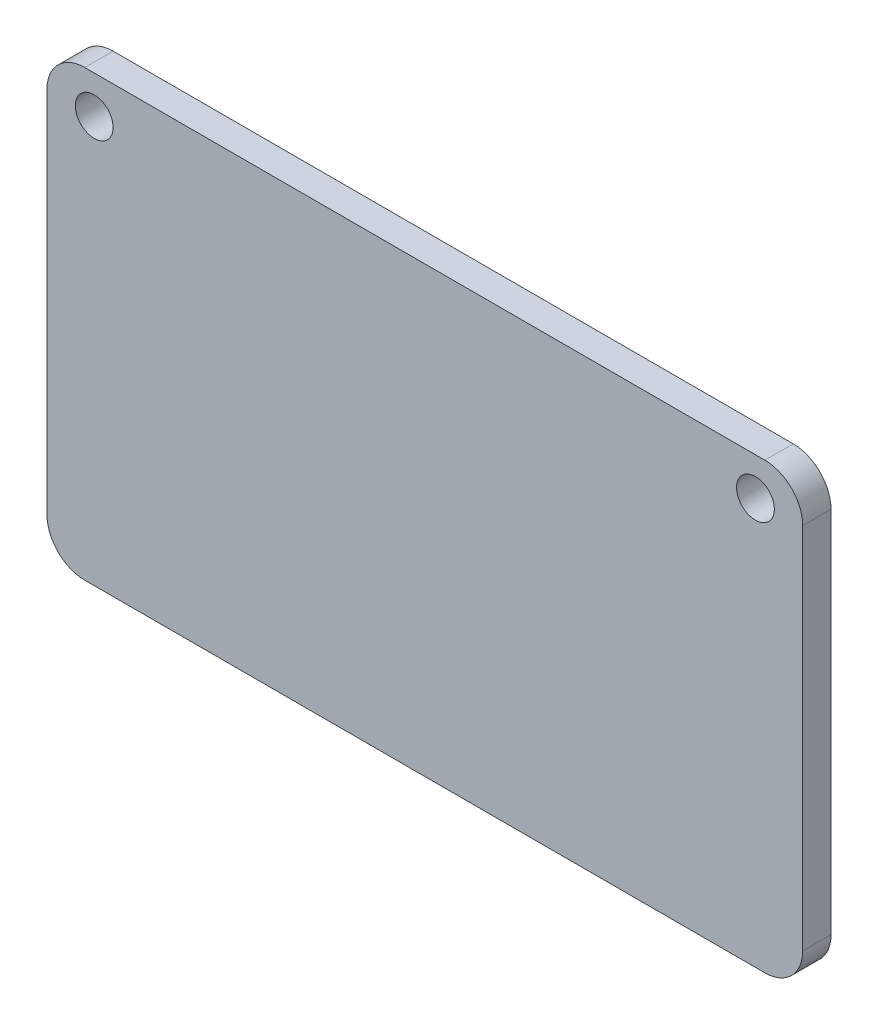
ISO-10303-21;
HEADER;
FILE_DESCRIPTION(('STEP AP214'),'2;1');
FILE_NAME('part.step','',(''),(''),'','','');
FILE_SCHEMA(('AUTOMOTIVE_DESIGN { 1 0 10303 214 1 1 1 1 }'));
ENDSEC;
DATA;
#1=APPLICATION_CONTEXT('core data for automotive mechanical design processes');
#2=APPLICATION_PROTOCOL_DEFINITION('international standard','automotive_design',2000,#1);
#3=PRODUCT_CONTEXT('',#1,'mechanical');
#4=PRODUCT('Part','Part','',(#3));
#5=PRODUCT_RELATED_PRODUCT_CATEGORY('part','',(#4));
#6=PRODUCT_DEFINITION_FORMATION('','',#4);
#7=PRODUCT_DEFINITION_CONTEXT('part definition',#1,'design');
#8=PRODUCT_DEFINITION('design','',#6,#7);
#9=PRODUCT_DEFINITION_SHAPE('','',#8);
#10=(LENGTH_UNIT() NAMED_UNIT(*) SI_UNIT(.MILLI.,.METRE.));
#11=(NAMED_UNIT(*) PLANE_ANGLE_UNIT() SI_UNIT($,.RADIAN.));
#12=(NAMED_UNIT(*) SI_UNIT($,.STERADIAN.) SOLID_ANGLE_UNIT());
#13=UNCERTAINTY_MEASURE_WITH_UNIT(LENGTH_MEASURE(1.E-05),#10,'distance_accuracy_value','');
#14=(GEOMETRIC_REPRESENTATION_CONTEXT(3) GLOBAL_UNCERTAINTY_ASSIGNED_CONTEXT((#13)) GLOBAL_UNIT_ASSIGNED_CONTEXT((#10,
#11,#12)) REPRESENTATION_CONTEXT('',''));
#15=CARTESIAN_POINT('',(0.,0.,0.));
#16=DIRECTION('',(0.,0.,1.));
#17=DIRECTION('',(1.,0.,0.));
#18=AXIS2_PLACEMENT_3D('',#15,#16,#17);
#19=CARTESIAN_POINT('',(0.,0.,3.));
#20=DIRECTION('',(0.,0.,1.));
#21=DIRECTION('',(1.,0.,0.));
#22=AXIS2_PLACEMENT_3D('',#19,#20,#21);
#23=PLANE('',#22);
#24=CARTESIAN_POINT('',(5.,-4.,3.));
#25=DIRECTION('',(0.,0.,1.));
#26=DIRECTION('',(1.,0.,0.));
#27=AXIS2_PLACEMENT_3D('',#24,#25,#26);
#28=CIRCLE('',#27,2.);
#29=CARTESIAN_POINT('',(7.,-4.,3.));
#30=VERTEX_POINT('',#29);
#31=EDGE_CURVE('E164',#30,#30,#28,.T.);
#32=ORIENTED_EDGE('',*,*,#31,.F.);
#33=EDGE_LOOP('',(#32));
#34=FACE_BOUND('',#33,.T.);
#35=DIRECTION('',(1.,0.,0.));
#36=VECTOR('',#35,1.);
#37=CARTESIAN_POINT('',(0.,-47.,3.));
#38=LINE('',#37,#36);
#39=CARTESIAN_POINT('',(4.00000000000001,-47.,3.));
#40=VERTEX_POINT('',#39);
#41=CARTESIAN_POINT('',(76.,-47.,3.));
#42=VERTEX_POINT('',#41);
#43=EDGE_CURVE('E171',#40,#42,#38,.T.);
#44=ORIENTED_EDGE('',*,*,#43,.T.);
#45=CARTESIAN_POINT('',(76.,-43.,3.));
#46=DIRECTION('',(0.,0.,1.));
#47=DIRECTION('',(1.,0.,0.));
#48=AXIS2_PLACEMENT_3D('',#45,#46,#47);
#49=CIRCLE('',#48,4.);
#50=CARTESIAN_POINT('',(80.,-43.,3.));
#51=VERTEX_POINT('',#50);
#52=EDGE_CURVE('E148',#42,#51,#49,.T.);
#53=ORIENTED_EDGE('',*,*,#52,.T.);
#54=DIRECTION('',(0.,1.,0.));
#55=VECTOR('',#54,1.);
#56=CARTESIAN_POINT('',(80.,0.,3.));
#57=LINE('',#56,#55);
#58=CARTESIAN_POINT('',(80.,-3.99999999999999,3.));
#59=VERTEX_POINT('',#58);
#60=EDGE_CURVE('E118',#51,#59,#57,.T.);
#61=ORIENTED_EDGE('',*,*,#60,.T.);
#62=CARTESIAN_POINT('',(76.,-3.99999999999999,3.));
#63=DIRECTION('',(0.,0.,1.));
#64=DIRECTION('',(1.,0.,0.));
#65=AXIS2_PLACEMENT_3D('',#62,#63,#64);
#66=CIRCLE('',#65,4.);
#67=CARTESIAN_POINT('',(76.,0.,3.));
#68=VERTEX_POINT('',#67);
#69=EDGE_CURVE('E55',#59,#68,#66,.T.);
#70=ORIENTED_EDGE('',*,*,#69,.T.);
#71=DIRECTION('',(-1.,0.,0.));
#72=VECTOR('',#71,1.);
#73=CARTESIAN_POINT('',(0.,0.,3.));
#74=LINE('',#73,#72);
#75=CARTESIAN_POINT('',(4.,0.,3.));
#76=VERTEX_POINT('',#75);
#77=EDGE_CURVE('E134',#68,#76,#74,.T.);
#78=ORIENTED_EDGE('',*,*,#77,.T.);
#79=CARTESIAN_POINT('',(4.,-4.,3.));
#80=DIRECTION('',(0.,0.,1.));
#81=DIRECTION('',(1.,0.,0.));
#82=AXIS2_PLACEMENT_3D('',#79,#80,#81);
#83=CIRCLE('',#82,4.);
#84=CARTESIAN_POINT('',(0.,-4.,3.));
#85=VERTEX_POINT('',#84);
#86=EDGE_CURVE('E143',#76,#85,#83,.T.);
#87=ORIENTED_EDGE('',*,*,#86,.T.);
#88=DIRECTION('',(0.,-1.,0.));
#89=VECTOR('',#88,1.);
#90=CARTESIAN_POINT('',(0.,0.,3.));
#91=LINE('',#90,#89);
#92=CARTESIAN_POINT('',(0.,-43.,3.));
#93=VERTEX_POINT('',#92);
#94=EDGE_CURVE('E128',#85,#93,#91,.T.);
#95=ORIENTED_EDGE('',*,*,#94,.T.);
#96=CARTESIAN_POINT('',(4.00000000000001,-43.,3.));
#97=DIRECTION('',(0.,0.,1.));
#98=DIRECTION('',(1.,0.,0.));
#99=AXIS2_PLACEMENT_3D('',#96,#97,#98);
#100=CIRCLE('',#99,4.);
#101=EDGE_CURVE('E145',#93,#40,#100,.T.);
#102=ORIENTED_EDGE('',*,*,#101,.T.);
#103=EDGE_LOOP('',(#44,#53,#61,#70,#78,#87,#95,#102));
#104=FACE_BOUND('',#103,.T.);
#105=CARTESIAN_POINT('',(75.,-3.99999999999999,3.));
#106=DIRECTION('',(0.,0.,1.));
#107=DIRECTION('',(-1.,0.,0.));
#108=AXIS2_PLACEMENT_3D('',#105,#106,#107);
#109=CIRCLE('',#108,1.99999999999998);
#110=CARTESIAN_POINT('',(73.,-3.99999999999999,3.));
#111=VERTEX_POINT('',#110);
#112=EDGE_CURVE('E176',#111,#111,#109,.T.);
#113=ORIENTED_EDGE('',*,*,#112,.F.);
#114=EDGE_LOOP('',(#113));
#115=FACE_BOUND('',#114,.T.);
#116=ADVANCED_FACE('F33',(#34,#104,#115),#23,.T.);
#117=CARTESIAN_POINT('',(0.,0.,0.));
#118=DIRECTION('',(0.,0.,1.));
#119=DIRECTION('',(1.,0.,0.));
#120=AXIS2_PLACEMENT_3D('',#117,#118,#119);
#121=PLANE('',#120);
#122=DIRECTION('',(0.,1.,0.));
#123=VECTOR('',#122,1.);
#124=CARTESIAN_POINT('',(80.,0.,0.));
#125=LINE('',#124,#123);
#126=CARTESIAN_POINT('',(80.,-43.,0.));
#127=VERTEX_POINT('',#126);
#128=CARTESIAN_POINT('',(80.,-3.99999999999999,0.));
#129=VERTEX_POINT('',#128);
#130=EDGE_CURVE('E116',#127,#129,#125,.T.);
#131=ORIENTED_EDGE('',*,*,#130,.F.);
#132=CARTESIAN_POINT('',(76.,-43.,0.));
#133=DIRECTION('',(0.,0.,1.));
#134=DIRECTION('',(1.,0.,0.));
#135=AXIS2_PLACEMENT_3D('',#132,#133,#134);
#136=CIRCLE('',#135,4.);
#137=CARTESIAN_POINT('',(76.,-47.,0.));
#138=VERTEX_POINT('',#137);
#139=EDGE_CURVE('E99',#127,#138,#136,.F.);
#140=ORIENTED_EDGE('',*,*,#139,.T.);
#141=DIRECTION('',(1.,0.,0.));
#142=VECTOR('',#141,1.);
#143=CARTESIAN_POINT('',(0.,-47.,0.));
#144=LINE('',#143,#142);
#145=CARTESIAN_POINT('',(4.00000000000001,-47.,0.));
#146=VERTEX_POINT('',#145);
#147=EDGE_CURVE('E126',#146,#138,#144,.T.);
#148=ORIENTED_EDGE('',*,*,#147,.F.);
#149=CARTESIAN_POINT('',(4.00000000000001,-43.,0.));
#150=DIRECTION('',(0.,0.,1.));
#151=DIRECTION('',(1.,0.,0.));
#152=AXIS2_PLACEMENT_3D('',#149,#150,#151);
#153=CIRCLE('',#152,4.);
#154=CARTESIAN_POINT('',(0.,-43.,0.));
#155=VERTEX_POINT('',#154);
#156=EDGE_CURVE('E137',#146,#155,#153,.F.);
#157=ORIENTED_EDGE('',*,*,#156,.T.);
#158=DIRECTION('',(0.,-1.,0.));
#159=VECTOR('',#158,1.);
#160=CARTESIAN_POINT('',(0.,0.,0.));
#161=LINE('',#160,#159);
#162=CARTESIAN_POINT('',(0.,-4.,0.));
#163=VERTEX_POINT('',#162);
#164=EDGE_CURVE('E130',#163,#155,#161,.T.);
#165=ORIENTED_EDGE('',*,*,#164,.F.);
#166=CARTESIAN_POINT('',(4.,-4.,0.));
#167=DIRECTION('',(0.,0.,1.));
#168=DIRECTION('',(1.,0.,0.));
#169=AXIS2_PLACEMENT_3D('',#166,#167,#168);
#170=CIRCLE('',#169,4.);
#171=CARTESIAN_POINT('',(4.,0.,0.));
#172=VERTEX_POINT('',#171);
#173=EDGE_CURVE('E119',#163,#172,#170,.F.);
#174=ORIENTED_EDGE('',*,*,#173,.T.);
#175=DIRECTION('',(-1.,0.,0.));
#176=VECTOR('',#175,1.);
#177=CARTESIAN_POINT('',(0.,0.,0.));
#178=LINE('',#177,#176);
#179=CARTESIAN_POINT('',(76.,0.,0.));
#180=VERTEX_POINT('',#179);
#181=EDGE_CURVE('E125',#180,#172,#178,.T.);
#182=ORIENTED_EDGE('',*,*,#181,.F.);
#183=CARTESIAN_POINT('',(76.,-3.99999999999999,0.));
#184=DIRECTION('',(0.,0.,1.));
#185=DIRECTION('',(1.,0.,0.));
#186=AXIS2_PLACEMENT_3D('',#183,#184,#185);
#187=CIRCLE('',#186,4.);
#188=EDGE_CURVE('E110',#180,#129,#187,.F.);
#189=ORIENTED_EDGE('',*,*,#188,.T.);
#190=EDGE_LOOP('',(#131,#140,#148,#157,#165,#174,#182,#189));
#191=FACE_BOUND('',#190,.T.);
#192=CARTESIAN_POINT('',(5.,-4.,0.));
#193=DIRECTION('',(0.,0.,1.));
#194=DIRECTION('',(1.,0.,0.));
#195=AXIS2_PLACEMENT_3D('',#192,#193,#194);
#196=CIRCLE('',#195,2.);
#197=CARTESIAN_POINT('',(7.,-4.,0.));
#198=VERTEX_POINT('',#197);
#199=EDGE_CURVE('E166',#198,#198,#196,.T.);
#200=ORIENTED_EDGE('',*,*,#199,.T.);
#201=EDGE_LOOP('',(#200));
#202=FACE_BOUND('',#201,.T.);
#203=CARTESIAN_POINT('',(75.,-3.99999999999999,0.));
#204=DIRECTION('',(0.,0.,1.));
#205=DIRECTION('',(-1.,0.,0.));
#206=AXIS2_PLACEMENT_3D('',#203,#204,#205);
#207=CIRCLE('',#206,1.99999999999998);
#208=CARTESIAN_POINT('',(73.,-3.99999999999999,0.));
#209=VERTEX_POINT('',#208);
#210=EDGE_CURVE('E178',#209,#209,#207,.T.);
#211=ORIENTED_EDGE('',*,*,#210,.T.);
#212=EDGE_LOOP('',(#211));
#213=FACE_BOUND('',#212,.T.);
#214=ADVANCED_FACE('F122',(#191,#202,#213),#121,.F.);
#215=CARTESIAN_POINT('',(0.,0.,3.));
#216=DIRECTION('',(1.,0.,0.));
#217=DIRECTION('',(0.,1.,0.));
#218=AXIS2_PLACEMENT_3D('',#215,#216,#217);
#219=PLANE('',#218);
#220=ORIENTED_EDGE('',*,*,#164,.T.);
#221=DIRECTION('',(0.,0.,-1.));
#222=VECTOR('',#221,1.);
#223=CARTESIAN_POINT('',(0.,-43.,3.));
#224=LINE('',#223,#222);
#225=EDGE_CURVE('E11',#155,#93,#224,.F.);
#226=ORIENTED_EDGE('',*,*,#225,.T.);
#227=ORIENTED_EDGE('',*,*,#94,.F.);
#228=DIRECTION('',(0.,0.,-1.));
#229=VECTOR('',#228,1.);
#230=CARTESIAN_POINT('',(0.,-4.,3.));
#231=LINE('',#230,#229);
#232=EDGE_CURVE('E41',#85,#163,#231,.T.);
#233=ORIENTED_EDGE('',*,*,#232,.T.);
#234=EDGE_LOOP('',(#220,#226,#227,#233));
#235=FACE_BOUND('',#234,.T.);
#236=ADVANCED_FACE('F159',(#235),#219,.F.);
#237=CARTESIAN_POINT('',(0.,-47.,3.));
#238=DIRECTION('',(0.,1.,0.));
#239=DIRECTION('',(-1.,0.,0.));
#240=AXIS2_PLACEMENT_3D('',#237,#238,#239);
#241=PLANE('',#240);
#242=ORIENTED_EDGE('',*,*,#147,.T.);
#243=DIRECTION('',(0.,0.,-1.));
#244=VECTOR('',#243,1.);
#245=CARTESIAN_POINT('',(76.,-47.,3.));
#246=LINE('',#245,#244);
#247=EDGE_CURVE('E104',#138,#42,#246,.F.);
#248=ORIENTED_EDGE('',*,*,#247,.T.);
#249=ORIENTED_EDGE('',*,*,#43,.F.);
#250=DIRECTION('',(0.,0.,-1.));
#251=VECTOR('',#250,1.);
#252=CARTESIAN_POINT('',(4.00000000000001,-47.,3.));
#253=LINE('',#252,#251);
#254=EDGE_CURVE('E109',#40,#146,#253,.T.);
#255=ORIENTED_EDGE('',*,*,#254,.T.);
#256=EDGE_LOOP('',(#242,#248,#249,#255));
#257=FACE_BOUND('',#256,.T.);
#258=ADVANCED_FACE('F204',(#257),#241,.F.);
#259=CARTESIAN_POINT('',(80.,0.,3.));
#260=DIRECTION('',(-1.,0.,0.));
#261=DIRECTION('',(0.,0.,1.));
#262=AXIS2_PLACEMENT_3D('',#259,#260,#261);
#263=PLANE('',#262);
#264=ORIENTED_EDGE('',*,*,#60,.F.);
#265=DIRECTION('',(0.,0.,-1.));
#266=VECTOR('',#265,1.);
#267=CARTESIAN_POINT('',(80.,-43.,3.));
#268=LINE('',#267,#266);
#269=EDGE_CURVE('E103',#51,#127,#268,.T.);
#270=ORIENTED_EDGE('',*,*,#269,.T.);
#271=ORIENTED_EDGE('',*,*,#130,.T.);
#272=DIRECTION('',(0.,0.,-1.));
#273=VECTOR('',#272,1.);
#274=CARTESIAN_POINT('',(80.,-3.99999999999999,3.));
#275=LINE('',#274,#273);
#276=EDGE_CURVE('E120',#129,#59,#275,.F.);
#277=ORIENTED_EDGE('',*,*,#276,.T.);
#278=EDGE_LOOP('',(#264,#270,#271,#277));
#279=FACE_BOUND('',#278,.T.);
#280=ADVANCED_FACE('F115',(#279),#263,.F.);
#281=CARTESIAN_POINT('',(0.,0.,3.));
#282=DIRECTION('',(0.,-1.,0.));
#283=DIRECTION('',(1.,0.,0.));
#284=AXIS2_PLACEMENT_3D('',#281,#282,#283);
#285=PLANE('',#284);
#286=ORIENTED_EDGE('',*,*,#77,.F.);
#287=DIRECTION('',(0.,0.,-1.));
#288=VECTOR('',#287,1.);
#289=CARTESIAN_POINT('',(76.,0.,3.));
#290=LINE('',#289,#288);
#291=EDGE_CURVE('E151',#68,#180,#290,.T.);
#292=ORIENTED_EDGE('',*,*,#291,.T.);
#293=ORIENTED_EDGE('',*,*,#181,.T.);
#294=DIRECTION('',(0.,0.,-1.));
#295=VECTOR('',#294,1.);
#296=CARTESIAN_POINT('',(4.,0.,3.));
#297=LINE('',#296,#295);
#298=EDGE_CURVE('E48',#172,#76,#297,.F.);
#299=ORIENTED_EDGE('',*,*,#298,.T.);
#300=EDGE_LOOP('',(#286,#292,#293,#299));
#301=FACE_BOUND('',#300,.T.);
#302=ADVANCED_FACE('F199',(#301),#285,.F.);
#303=CARTESIAN_POINT('',(5.,-4.,3.));
#304=DIRECTION('',(0.,0.,-1.));
#305=DIRECTION('',(-1.,0.,0.));
#306=AXIS2_PLACEMENT_3D('',#303,#304,#305);
#307=CYLINDRICAL_SURFACE('',#306,2.);
#308=ORIENTED_EDGE('',*,*,#31,.T.);
#309=EDGE_LOOP('',(#308));
#310=FACE_BOUND('',#309,.T.);
#311=ORIENTED_EDGE('',*,*,#199,.F.);
#312=EDGE_LOOP('',(#311));
#313=FACE_BOUND('',#312,.T.);
#314=ADVANCED_FACE('F196',(#310,#313),#307,.F.);
#315=CARTESIAN_POINT('',(75.,-3.99999999999999,3.));
#316=DIRECTION('',(0.,0.,-1.));
#317=DIRECTION('',(-1.,0.,0.));
#318=AXIS2_PLACEMENT_3D('',#315,#316,#317);
#319=CYLINDRICAL_SURFACE('',#318,1.99999999999998);
#320=ORIENTED_EDGE('',*,*,#112,.T.);
#321=EDGE_LOOP('',(#320));
#322=FACE_BOUND('',#321,.T.);
#323=ORIENTED_EDGE('',*,*,#210,.F.);
#324=EDGE_LOOP('',(#323));
#325=FACE_BOUND('',#324,.T.);
#326=ADVANCED_FACE('F184',(#322,#325),#319,.F.);
#327=CARTESIAN_POINT('',(76.,-43.,3.));
#328=DIRECTION('',(0.,0.,-1.));
#329=DIRECTION('',(-1.,0.,0.));
#330=AXIS2_PLACEMENT_3D('',#327,#328,#329);
#331=CYLINDRICAL_SURFACE('',#330,4.);
#332=ORIENTED_EDGE('',*,*,#52,.F.);
#333=ORIENTED_EDGE('',*,*,#247,.F.);
#334=ORIENTED_EDGE('',*,*,#139,.F.);
#335=ORIENTED_EDGE('',*,*,#269,.F.);
#336=EDGE_LOOP('',(#332,#333,#334,#335));
#337=FACE_BOUND('',#336,.T.);
#338=ADVANCED_FACE('F102',(#337),#331,.T.);
#339=CARTESIAN_POINT('',(76.,-3.99999999999999,3.));
#340=DIRECTION('',(0.,0.,-1.));
#341=DIRECTION('',(-1.,0.,0.));
#342=AXIS2_PLACEMENT_3D('',#339,#340,#341);
#343=CYLINDRICAL_SURFACE('',#342,4.);
#344=ORIENTED_EDGE('',*,*,#69,.F.);
#345=ORIENTED_EDGE('',*,*,#276,.F.);
#346=ORIENTED_EDGE('',*,*,#188,.F.);
#347=ORIENTED_EDGE('',*,*,#291,.F.);
#348=EDGE_LOOP('',(#344,#345,#346,#347));
#349=FACE_BOUND('',#348,.T.);
#350=ADVANCED_FACE('F212',(#349),#343,.T.);
#351=CARTESIAN_POINT('',(4.00000000000001,-43.,3.));
#352=DIRECTION('',(0.,0.,-1.));
#353=DIRECTION('',(-1.,0.,0.));
#354=AXIS2_PLACEMENT_3D('',#351,#352,#353);
#355=CYLINDRICAL_SURFACE('',#354,4.);
#356=ORIENTED_EDGE('',*,*,#101,.F.);
#357=ORIENTED_EDGE('',*,*,#225,.F.);
#358=ORIENTED_EDGE('',*,*,#156,.F.);
#359=ORIENTED_EDGE('',*,*,#254,.F.);
#360=EDGE_LOOP('',(#356,#357,#358,#359));
#361=FACE_BOUND('',#360,.T.);
#362=ADVANCED_FACE('F214',(#361),#355,.T.);
#363=CARTESIAN_POINT('',(4.,-4.,3.));
#364=DIRECTION('',(0.,0.,-1.));
#365=DIRECTION('',(-1.,0.,0.));
#366=AXIS2_PLACEMENT_3D('',#363,#364,#365);
#367=CYLINDRICAL_SURFACE('',#366,4.);
#368=ORIENTED_EDGE('',*,*,#86,.F.);
#369=ORIENTED_EDGE('',*,*,#298,.F.);
#370=ORIENTED_EDGE('',*,*,#173,.F.);
#371=ORIENTED_EDGE('',*,*,#232,.F.);
#372=EDGE_LOOP('',(#368,#369,#370,#371));
#373=FACE_BOUND('',#372,.T.);
#374=ADVANCED_FACE('F35',(#373),#367,.T.);
#375=CLOSED_SHELL('',(#116,#214,#236,#258,#280,#302,#314,#326,#338,#350,#362,#374));
#376=MANIFOLD_SOLID_BREP('B2',#375);
#377=ADVANCED_BREP_SHAPE_REPRESENTATION('',(#18,#376),#14);
#378=SHAPE_DEFINITION_REPRESENTATION(#9,#377);
ENDSEC;
END-ISO-10303-21;
